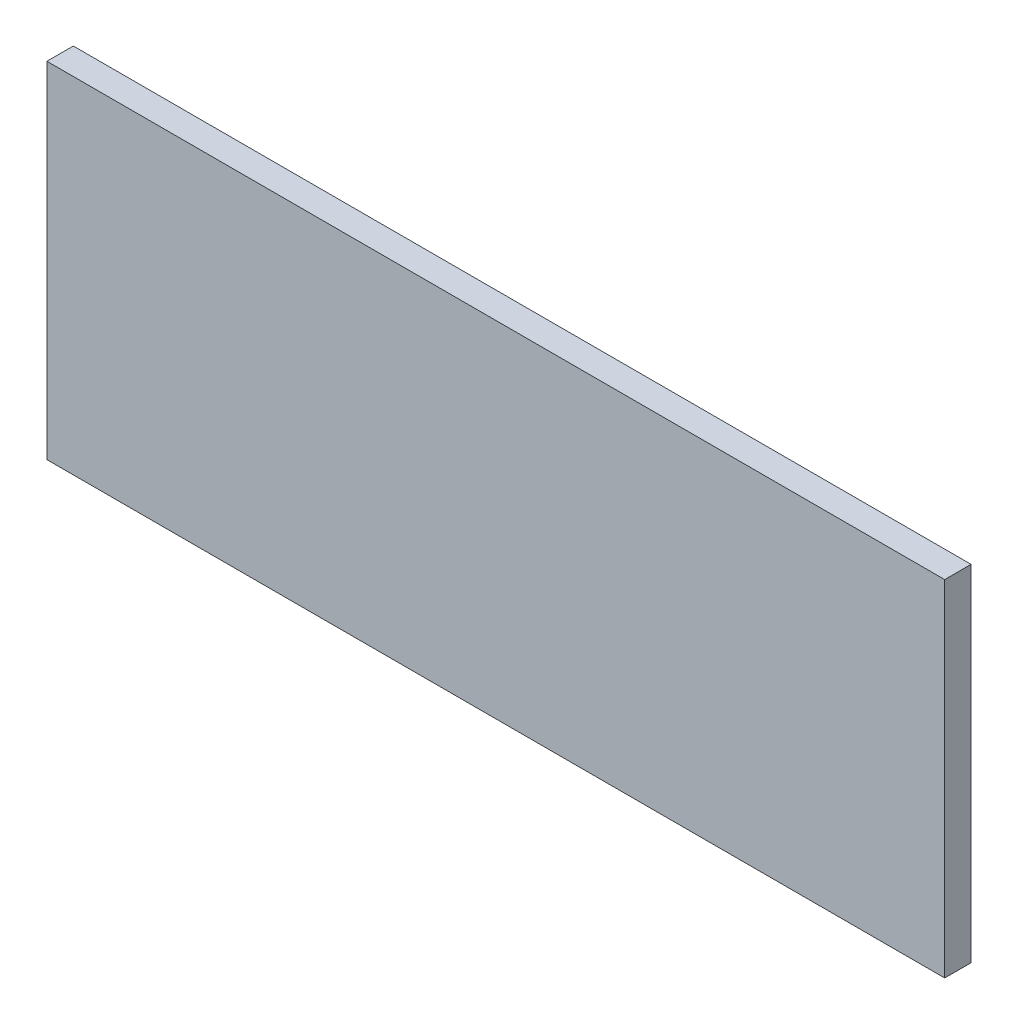
ISO-10303-21;
HEADER;
FILE_DESCRIPTION(('STEP AP214'),'2;1');
FILE_NAME('part.step','',(''),(''),'','','');
FILE_SCHEMA(('AUTOMOTIVE_DESIGN { 1 0 10303 214 1 1 1 1 }'));
ENDSEC;
DATA;
#1=APPLICATION_CONTEXT('core data for automotive mechanical design processes');
#2=APPLICATION_PROTOCOL_DEFINITION('international standard','automotive_design',2000,#1);
#3=PRODUCT_CONTEXT('',#1,'mechanical');
#4=PRODUCT('Part','Part','',(#3));
#5=PRODUCT_RELATED_PRODUCT_CATEGORY('part','',(#4));
#6=PRODUCT_DEFINITION_FORMATION('','',#4);
#7=PRODUCT_DEFINITION_CONTEXT('part definition',#1,'design');
#8=PRODUCT_DEFINITION('design','',#6,#7);
#9=PRODUCT_DEFINITION_SHAPE('','',#8);
#10=(LENGTH_UNIT() NAMED_UNIT(*) SI_UNIT(.MILLI.,.METRE.));
#11=(NAMED_UNIT(*) PLANE_ANGLE_UNIT() SI_UNIT($,.RADIAN.));
#12=(NAMED_UNIT(*) SI_UNIT($,.STERADIAN.) SOLID_ANGLE_UNIT());
#13=UNCERTAINTY_MEASURE_WITH_UNIT(LENGTH_MEASURE(1.E-05),#10,'distance_accuracy_value','');
#14=(GEOMETRIC_REPRESENTATION_CONTEXT(3) GLOBAL_UNCERTAINTY_ASSIGNED_CONTEXT((#13)) GLOBAL_UNIT_ASSIGNED_CONTEXT((#10,
#11,#12)) REPRESENTATION_CONTEXT('',''));
#15=CARTESIAN_POINT('',(0.,0.,0.));
#16=DIRECTION('',(0.,0.,1.));
#17=DIRECTION('',(1.,0.,0.));
#18=AXIS2_PLACEMENT_3D('',#15,#16,#17);
#19=CARTESIAN_POINT('',(0.,0.,-30.));
#20=DIRECTION('',(0.,0.,1.));
#21=DIRECTION('',(1.,0.,0.));
#22=AXIS2_PLACEMENT_3D('',#19,#20,#21);
#23=PLANE('',#22);
#24=DIRECTION('',(0.,-1.,0.));
#25=VECTOR('',#24,1.);
#26=CARTESIAN_POINT('',(-25.0000000000008,0.,-30.));
#27=LINE('',#26,#25);
#28=CARTESIAN_POINT('',(-25.0000000000007,-1063.,-30.));
#29=VERTEX_POINT('',#28);
#30=CARTESIAN_POINT('',(-25.0000000000008,-1455.,-30.));
#31=VERTEX_POINT('',#30);
#32=EDGE_CURVE('E11',#29,#31,#27,.T.);
#33=ORIENTED_EDGE('',*,*,#32,.F.);
#34=DIRECTION('',(1.,0.,0.));
#35=VECTOR('',#34,1.);
#36=CARTESIAN_POINT('',(-25.0000000000007,-1063.,-30.));
#37=LINE('',#36,#35);
#38=CARTESIAN_POINT('',(994.999999999999,-1063.,-30.));
#39=VERTEX_POINT('',#38);
#40=EDGE_CURVE('E77',#29,#39,#37,.T.);
#41=ORIENTED_EDGE('',*,*,#40,.T.);
#42=DIRECTION('',(0.,-1.,0.));
#43=VECTOR('',#42,1.);
#44=CARTESIAN_POINT('',(994.999999999999,1.7396408023654E-13,-30.));
#45=LINE('',#44,#43);
#46=CARTESIAN_POINT('',(994.999999999999,-1455.,-30.));
#47=VERTEX_POINT('',#46);
#48=EDGE_CURVE('E95',#39,#47,#45,.T.);
#49=ORIENTED_EDGE('',*,*,#48,.T.);
#50=DIRECTION('',(-1.,0.,0.));
#51=VECTOR('',#50,1.);
#52=CARTESIAN_POINT('',(2895.,-1455.,-30.));
#53=LINE('',#52,#51);
#54=EDGE_CURVE('E93',#47,#31,#53,.T.);
#55=ORIENTED_EDGE('',*,*,#54,.T.);
#56=EDGE_LOOP('',(#33,#41,#49,#55));
#57=FACE_BOUND('',#56,.T.);
#58=ADVANCED_FACE('F38',(#57),#23,.F.);
#59=CARTESIAN_POINT('',(0.,0.,0.));
#60=DIRECTION('',(0.,0.,1.));
#61=DIRECTION('',(1.,0.,0.));
#62=AXIS2_PLACEMENT_3D('',#59,#60,#61);
#63=PLANE('',#62);
#64=DIRECTION('',(1.,0.,0.));
#65=VECTOR('',#64,1.);
#66=CARTESIAN_POINT('',(0.,-1063.,0.));
#67=LINE('',#66,#65);
#68=CARTESIAN_POINT('',(-25.0000000000007,-1063.,0.));
#69=VERTEX_POINT('',#68);
#70=CARTESIAN_POINT('',(994.999999999999,-1063.,0.));
#71=VERTEX_POINT('',#70);
#72=EDGE_CURVE('E53',#69,#71,#67,.T.);
#73=ORIENTED_EDGE('',*,*,#72,.F.);
#74=DIRECTION('',(0.,-1.,0.));
#75=VECTOR('',#74,1.);
#76=CARTESIAN_POINT('',(-25.0000000000008,0.,0.));
#77=LINE('',#76,#75);
#78=CARTESIAN_POINT('',(-25.0000000000008,-1455.,0.));
#79=VERTEX_POINT('',#78);
#80=EDGE_CURVE('E42',#69,#79,#77,.T.);
#81=ORIENTED_EDGE('',*,*,#80,.T.);
#82=DIRECTION('',(-1.,0.,0.));
#83=VECTOR('',#82,1.);
#84=CARTESIAN_POINT('',(2.21284178195836E-13,-1455.,0.));
#85=LINE('',#84,#83);
#86=CARTESIAN_POINT('',(994.999999999999,-1455.,0.));
#87=VERTEX_POINT('',#86);
#88=EDGE_CURVE('E102',#87,#79,#85,.T.);
#89=ORIENTED_EDGE('',*,*,#88,.F.);
#90=DIRECTION('',(0.,-1.,0.));
#91=VECTOR('',#90,1.);
#92=CARTESIAN_POINT('',(994.999999999999,1.7396408023654E-13,0.));
#93=LINE('',#92,#91);
#94=EDGE_CURVE('E60',#71,#87,#93,.T.);
#95=ORIENTED_EDGE('',*,*,#94,.F.);
#96=EDGE_LOOP('',(#73,#81,#89,#95));
#97=FACE_BOUND('',#96,.T.);
#98=ADVANCED_FACE('F40',(#97),#63,.T.);
#99=CARTESIAN_POINT('',(-25.0000000000008,0.,-30.));
#100=DIRECTION('',(-1.,0.,0.));
#101=DIRECTION('',(0.,-1.,0.));
#102=AXIS2_PLACEMENT_3D('',#99,#100,#101);
#103=PLANE('',#102);
#104=DIRECTION('',(0.,0.,1.));
#105=VECTOR('',#104,1.);
#106=CARTESIAN_POINT('',(-25.0000000000007,-1063.,-30.));
#107=LINE('',#106,#105);
#108=EDGE_CURVE('E80',#29,#69,#107,.T.);
#109=ORIENTED_EDGE('',*,*,#108,.F.);
#110=ORIENTED_EDGE('',*,*,#32,.T.);
#111=DIRECTION('',(0.,0.,1.));
#112=VECTOR('',#111,1.);
#113=CARTESIAN_POINT('',(-25.0000000000008,-1455.,-30.));
#114=LINE('',#113,#112);
#115=EDGE_CURVE('E97',#31,#79,#114,.T.);
#116=ORIENTED_EDGE('',*,*,#115,.T.);
#117=ORIENTED_EDGE('',*,*,#80,.F.);
#118=EDGE_LOOP('',(#109,#110,#116,#117));
#119=FACE_BOUND('',#118,.T.);
#120=ADVANCED_FACE('F88',(#119),#103,.T.);
#121=CARTESIAN_POINT('',(2895.,-1455.,-30.));
#122=DIRECTION('',(0.,1.,0.));
#123=DIRECTION('',(-1.,0.,0.));
#124=AXIS2_PLACEMENT_3D('',#121,#122,#123);
#125=PLANE('',#124);
#126=ORIENTED_EDGE('',*,*,#54,.F.);
#127=DIRECTION('',(0.,0.,1.));
#128=VECTOR('',#127,1.);
#129=CARTESIAN_POINT('',(994.999999999999,-1455.,-30.));
#130=LINE('',#129,#128);
#131=EDGE_CURVE('E107',#47,#87,#130,.T.);
#132=ORIENTED_EDGE('',*,*,#131,.T.);
#133=ORIENTED_EDGE('',*,*,#88,.T.);
#134=ORIENTED_EDGE('',*,*,#115,.F.);
#135=EDGE_LOOP('',(#126,#132,#133,#134));
#136=FACE_BOUND('',#135,.T.);
#137=ADVANCED_FACE('F100',(#136),#125,.F.);
#138=CARTESIAN_POINT('',(994.999999999999,1.7396408023654E-13,-30.));
#139=DIRECTION('',(-1.,0.,0.));
#140=DIRECTION('',(0.,-1.,0.));
#141=AXIS2_PLACEMENT_3D('',#138,#139,#140);
#142=PLANE('',#141);
#143=ORIENTED_EDGE('',*,*,#48,.F.);
#144=DIRECTION('',(0.,0.,1.));
#145=VECTOR('',#144,1.);
#146=CARTESIAN_POINT('',(994.999999999999,-1063.,-30.));
#147=LINE('',#146,#145);
#148=EDGE_CURVE('E81',#39,#71,#147,.T.);
#149=ORIENTED_EDGE('',*,*,#148,.T.);
#150=ORIENTED_EDGE('',*,*,#94,.T.);
#151=ORIENTED_EDGE('',*,*,#131,.F.);
#152=EDGE_LOOP('',(#143,#149,#150,#151));
#153=FACE_BOUND('',#152,.T.);
#154=ADVANCED_FACE('F111',(#153),#142,.F.);
#155=CARTESIAN_POINT('',(-25.0000000000007,-1063.,-30.));
#156=DIRECTION('',(0.,-1.,0.));
#157=DIRECTION('',(0.,0.,-1.));
#158=AXIS2_PLACEMENT_3D('',#155,#156,#157);
#159=PLANE('',#158);
#160=ORIENTED_EDGE('',*,*,#72,.T.);
#161=ORIENTED_EDGE('',*,*,#148,.F.);
#162=ORIENTED_EDGE('',*,*,#40,.F.);
#163=ORIENTED_EDGE('',*,*,#108,.T.);
#164=EDGE_LOOP('',(#160,#161,#162,#163));
#165=FACE_BOUND('',#164,.T.);
#166=ADVANCED_FACE('F79',(#165),#159,.F.);
#167=CLOSED_SHELL('',(#58,#98,#120,#137,#154,#166));
#168=MANIFOLD_SOLID_BREP('B2',#167);
#169=ADVANCED_BREP_SHAPE_REPRESENTATION('',(#18,#168),#14);
#170=SHAPE_DEFINITION_REPRESENTATION(#9,#169);
ENDSEC;
END-ISO-10303-21;
